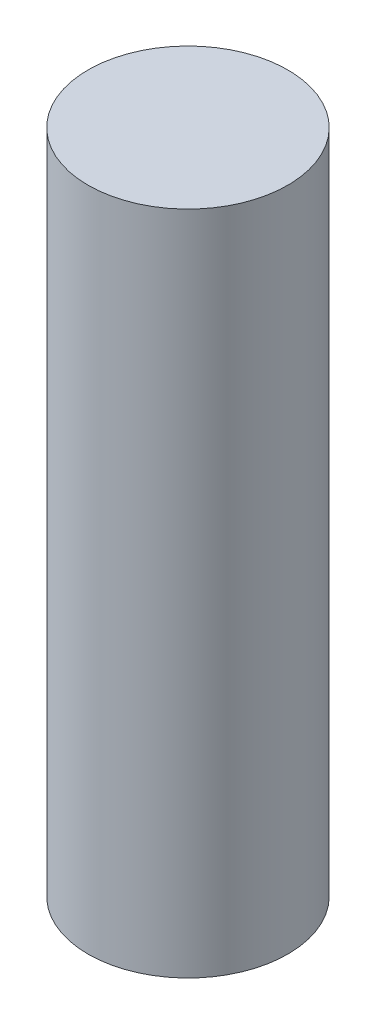
ISO-10303-21;
HEADER;
FILE_DESCRIPTION(('STEP AP214'),'2;1');
FILE_NAME('part.step','',(''),(''),'','','');
FILE_SCHEMA(('AUTOMOTIVE_DESIGN { 1 0 10303 214 1 1 1 1 }'));
ENDSEC;
DATA;
#1=APPLICATION_CONTEXT('core data for automotive mechanical design processes');
#2=APPLICATION_PROTOCOL_DEFINITION('international standard','automotive_design',2000,#1);
#3=PRODUCT_CONTEXT('',#1,'mechanical');
#4=PRODUCT('Part','Part','',(#3));
#5=PRODUCT_RELATED_PRODUCT_CATEGORY('part','',(#4));
#6=PRODUCT_DEFINITION_FORMATION('','',#4);
#7=PRODUCT_DEFINITION_CONTEXT('part definition',#1,'design');
#8=PRODUCT_DEFINITION('design','',#6,#7);
#9=PRODUCT_DEFINITION_SHAPE('','',#8);
#10=(LENGTH_UNIT() NAMED_UNIT(*) SI_UNIT(.MILLI.,.METRE.));
#11=(NAMED_UNIT(*) PLANE_ANGLE_UNIT() SI_UNIT($,.RADIAN.));
#12=(NAMED_UNIT(*) SI_UNIT($,.STERADIAN.) SOLID_ANGLE_UNIT());
#13=UNCERTAINTY_MEASURE_WITH_UNIT(LENGTH_MEASURE(1.E-05),#10,'distance_accuracy_value','');
#14=(GEOMETRIC_REPRESENTATION_CONTEXT(3) GLOBAL_UNCERTAINTY_ASSIGNED_CONTEXT((#13)) GLOBAL_UNIT_ASSIGNED_CONTEXT((#10,
#11,#12)) REPRESENTATION_CONTEXT('',''));
#15=CARTESIAN_POINT('',(0.,0.,0.));
#16=DIRECTION('',(0.,0.,1.));
#17=DIRECTION('',(1.,0.,0.));
#18=AXIS2_PLACEMENT_3D('',#15,#16,#17);
#19=CARTESIAN_POINT('',(0.,300.,0.));
#20=DIRECTION('',(0.,-1.,0.));
#21=DIRECTION('',(0.,0.,-1.));
#22=AXIS2_PLACEMENT_3D('',#19,#20,#21);
#23=CYLINDRICAL_SURFACE('',#22,45.);
#24=CARTESIAN_POINT('',(0.,300.,0.));
#25=DIRECTION('',(0.,1.,0.));
#26=DIRECTION('',(0.,0.,1.));
#27=AXIS2_PLACEMENT_3D('',#24,#25,#26);
#28=CIRCLE('',#27,45.);
#29=CARTESIAN_POINT('',(0.,300.,45.));
#30=VERTEX_POINT('',#29);
#31=EDGE_CURVE('E10',#30,#30,#28,.T.);
#32=ORIENTED_EDGE('',*,*,#31,.F.);
#33=EDGE_LOOP('',(#32));
#34=FACE_BOUND('',#33,.T.);
#35=CARTESIAN_POINT('',(0.,0.,0.));
#36=DIRECTION('',(0.,1.,0.));
#37=DIRECTION('',(0.,0.,1.));
#38=AXIS2_PLACEMENT_3D('',#35,#36,#37);
#39=CIRCLE('',#38,45.);
#40=CARTESIAN_POINT('',(0.,0.,45.));
#41=VERTEX_POINT('',#40);
#42=EDGE_CURVE('E42',#41,#41,#39,.T.);
#43=ORIENTED_EDGE('',*,*,#42,.T.);
#44=EDGE_LOOP('',(#43));
#45=FACE_BOUND('',#44,.T.);
#46=ADVANCED_FACE('F39',(#34,#45),#23,.T.);
#47=CARTESIAN_POINT('',(0.,300.,0.));
#48=DIRECTION('',(0.,1.,0.));
#49=DIRECTION('',(0.,0.,1.));
#50=AXIS2_PLACEMENT_3D('',#47,#48,#49);
#51=PLANE('',#50);
#52=ORIENTED_EDGE('',*,*,#31,.T.);
#53=EDGE_LOOP('',(#52));
#54=FACE_BOUND('',#53,.T.);
#55=ADVANCED_FACE('F56',(#54),#51,.T.);
#56=CARTESIAN_POINT('',(0.,0.,0.));
#57=DIRECTION('',(0.,1.,0.));
#58=DIRECTION('',(0.,0.,1.));
#59=AXIS2_PLACEMENT_3D('',#56,#57,#58);
#60=PLANE('',#59);
#61=ORIENTED_EDGE('',*,*,#42,.F.);
#62=EDGE_LOOP('',(#61));
#63=FACE_BOUND('',#62,.T.);
#64=ADVANCED_FACE('F54',(#63),#60,.F.);
#65=CLOSED_SHELL('',(#46,#55,#64));
#66=MANIFOLD_SOLID_BREP('B2',#65);
#67=ADVANCED_BREP_SHAPE_REPRESENTATION('',(#18,#66),#14);
#68=SHAPE_DEFINITION_REPRESENTATION(#9,#67);
ENDSEC;
END-ISO-10303-21;
